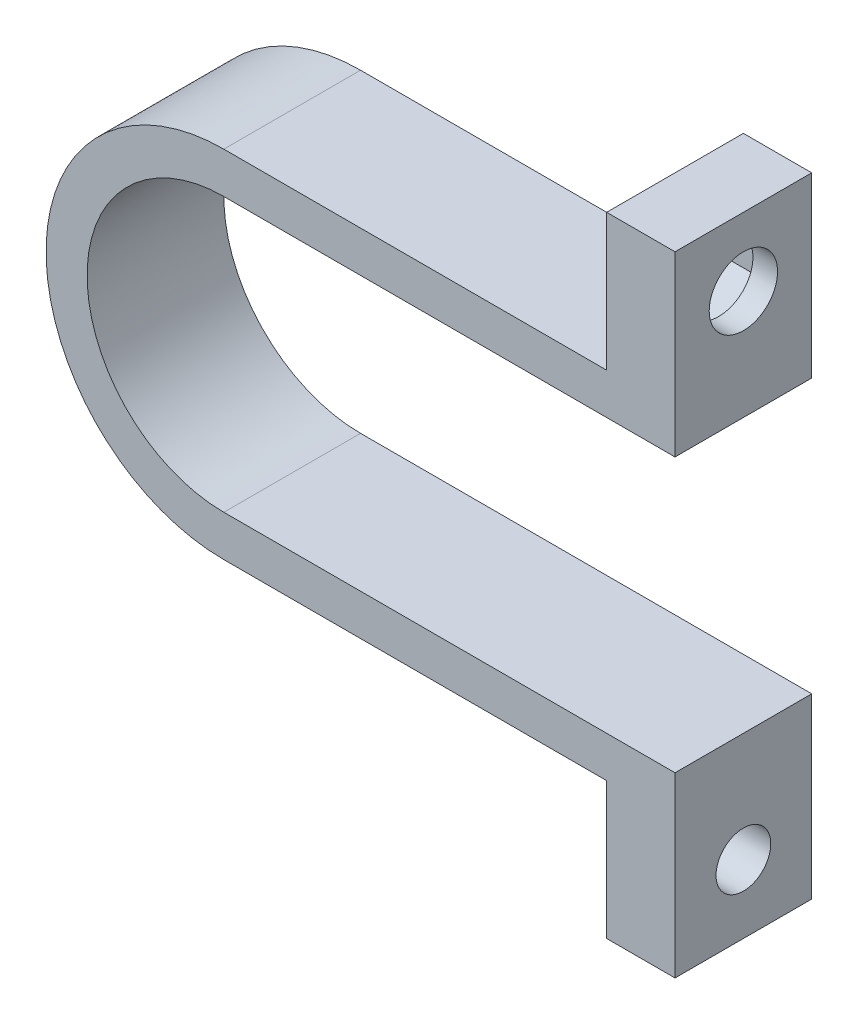
ISO-10303-21;
HEADER;
FILE_DESCRIPTION(('STEP AP214'),'2;1');
FILE_NAME('part.step','',(''),(''),'','','');
FILE_SCHEMA(('AUTOMOTIVE_DESIGN { 1 0 10303 214 1 1 1 1 }'));
ENDSEC;
DATA;
#1=APPLICATION_CONTEXT('core data for automotive mechanical design processes');
#2=APPLICATION_PROTOCOL_DEFINITION('international standard','automotive_design',2000,#1);
#3=PRODUCT_CONTEXT('',#1,'mechanical');
#4=PRODUCT('Part','Part','',(#3));
#5=PRODUCT_RELATED_PRODUCT_CATEGORY('part','',(#4));
#6=PRODUCT_DEFINITION_FORMATION('','',#4);
#7=PRODUCT_DEFINITION_CONTEXT('part definition',#1,'design');
#8=PRODUCT_DEFINITION('design','',#6,#7);
#9=PRODUCT_DEFINITION_SHAPE('','',#8);
#10=(LENGTH_UNIT() NAMED_UNIT(*) SI_UNIT(.MILLI.,.METRE.));
#11=(NAMED_UNIT(*) PLANE_ANGLE_UNIT() SI_UNIT($,.RADIAN.));
#12=(NAMED_UNIT(*) SI_UNIT($,.STERADIAN.) SOLID_ANGLE_UNIT());
#13=UNCERTAINTY_MEASURE_WITH_UNIT(LENGTH_MEASURE(1.E-05),#10,'distance_accuracy_value','');
#14=(GEOMETRIC_REPRESENTATION_CONTEXT(3) GLOBAL_UNCERTAINTY_ASSIGNED_CONTEXT((#13)) GLOBAL_UNIT_ASSIGNED_CONTEXT((#10,
#11,#12)) REPRESENTATION_CONTEXT('',''));
#15=CARTESIAN_POINT('',(0.,0.,0.));
#16=DIRECTION('',(0.,0.,1.));
#17=DIRECTION('',(1.,0.,0.));
#18=AXIS2_PLACEMENT_3D('',#15,#16,#17);
#19=CARTESIAN_POINT('',(0.,0.,10.));
#20=DIRECTION('',(0.,0.,-1.));
#21=DIRECTION('',(-1.,0.,0.));
#22=AXIS2_PLACEMENT_3D('',#19,#20,#21);
#23=CYLINDRICAL_SURFACE('',#22,10.);
#24=CARTESIAN_POINT('',(0.,0.,0.));
#25=DIRECTION('',(0.,0.,-1.));
#26=DIRECTION('',(1.,0.,0.));
#27=AXIS2_PLACEMENT_3D('',#24,#25,#26);
#28=CIRCLE('',#27,10.);
#29=CARTESIAN_POINT('',(0.,-10.,0.));
#30=VERTEX_POINT('',#29);
#31=CARTESIAN_POINT('',(0.,10.,0.));
#32=VERTEX_POINT('',#31);
#33=EDGE_CURVE('E166',#30,#32,#28,.T.);
#34=ORIENTED_EDGE('',*,*,#33,.T.);
#35=DIRECTION('',(0.,0.,-1.));
#36=VECTOR('',#35,1.);
#37=CARTESIAN_POINT('',(0.,10.,10.));
#38=LINE('',#37,#36);
#39=CARTESIAN_POINT('',(0.,10.,10.));
#40=VERTEX_POINT('',#39);
#41=EDGE_CURVE('E11',#40,#32,#38,.T.);
#42=ORIENTED_EDGE('',*,*,#41,.F.);
#43=CARTESIAN_POINT('',(0.,0.,10.));
#44=DIRECTION('',(0.,0.,-1.));
#45=DIRECTION('',(1.,0.,0.));
#46=AXIS2_PLACEMENT_3D('',#43,#44,#45);
#47=CIRCLE('',#46,10.);
#48=CARTESIAN_POINT('',(0.,-10.,10.));
#49=VERTEX_POINT('',#48);
#50=EDGE_CURVE('E190',#49,#40,#47,.T.);
#51=ORIENTED_EDGE('',*,*,#50,.F.);
#52=DIRECTION('',(0.,0.,-1.));
#53=VECTOR('',#52,1.);
#54=CARTESIAN_POINT('',(0.,-10.,10.));
#55=LINE('',#54,#53);
#56=EDGE_CURVE('E162',#49,#30,#55,.T.);
#57=ORIENTED_EDGE('',*,*,#56,.T.);
#58=EDGE_LOOP('',(#34,#42,#51,#57));
#59=FACE_BOUND('',#58,.T.);
#60=ADVANCED_FACE('F33',(#59),#23,.F.);
#61=CARTESIAN_POINT('',(33.,10.,10.));
#62=DIRECTION('',(0.,1.,0.));
#63=DIRECTION('',(-1.,0.,0.));
#64=AXIS2_PLACEMENT_3D('',#61,#62,#63);
#65=PLANE('',#64);
#66=DIRECTION('',(1.,0.,0.));
#67=VECTOR('',#66,1.);
#68=CARTESIAN_POINT('',(33.,10.,0.));
#69=LINE('',#68,#67);
#70=CARTESIAN_POINT('',(33.,10.,0.));
#71=VERTEX_POINT('',#70);
#72=EDGE_CURVE('E169',#32,#71,#69,.T.);
#73=ORIENTED_EDGE('',*,*,#72,.T.);
#74=DIRECTION('',(0.,0.,-1.));
#75=VECTOR('',#74,1.);
#76=CARTESIAN_POINT('',(33.,10.,10.));
#77=LINE('',#76,#75);
#78=CARTESIAN_POINT('',(33.,10.,10.));
#79=VERTEX_POINT('',#78);
#80=EDGE_CURVE('E41',#79,#71,#77,.T.);
#81=ORIENTED_EDGE('',*,*,#80,.F.);
#82=DIRECTION('',(1.,0.,0.));
#83=VECTOR('',#82,1.);
#84=CARTESIAN_POINT('',(33.,10.,10.));
#85=LINE('',#84,#83);
#86=EDGE_CURVE('E110',#40,#79,#85,.T.);
#87=ORIENTED_EDGE('',*,*,#86,.F.);
#88=ORIENTED_EDGE('',*,*,#41,.T.);
#89=EDGE_LOOP('',(#73,#81,#87,#88));
#90=FACE_BOUND('',#89,.T.);
#91=ADVANCED_FACE('F339',(#90),#65,.F.);
#92=CARTESIAN_POINT('',(33.,23.,10.));
#93=DIRECTION('',(-1.,0.,0.));
#94=DIRECTION('',(0.,0.,1.));
#95=AXIS2_PLACEMENT_3D('',#92,#93,#94);
#96=PLANE('',#95);
#97=CARTESIAN_POINT('',(33.,18.,5.));
#98=DIRECTION('',(-1.,0.,0.));
#99=DIRECTION('',(0.,0.,1.));
#100=AXIS2_PLACEMENT_3D('',#97,#98,#99);
#101=CIRCLE('',#100,2.5);
#102=CARTESIAN_POINT('',(33.,18.,7.5));
#103=VERTEX_POINT('',#102);
#104=EDGE_CURVE('E311',#103,#103,#101,.T.);
#105=ORIENTED_EDGE('',*,*,#104,.T.);
#106=EDGE_LOOP('',(#105));
#107=FACE_BOUND('',#106,.T.);
#108=DIRECTION('',(0.,1.,0.));
#109=VECTOR('',#108,1.);
#110=CARTESIAN_POINT('',(33.,23.,0.));
#111=LINE('',#110,#109);
#112=CARTESIAN_POINT('',(33.,23.,0.));
#113=VERTEX_POINT('',#112);
#114=EDGE_CURVE('E172',#71,#113,#111,.T.);
#115=ORIENTED_EDGE('',*,*,#114,.T.);
#116=DIRECTION('',(0.,0.,-1.));
#117=VECTOR('',#116,1.);
#118=CARTESIAN_POINT('',(33.,23.,10.));
#119=LINE('',#118,#117);
#120=CARTESIAN_POINT('',(33.,23.,10.));
#121=VERTEX_POINT('',#120);
#122=EDGE_CURVE('E209',#121,#113,#119,.T.);
#123=ORIENTED_EDGE('',*,*,#122,.F.);
#124=DIRECTION('',(0.,1.,0.));
#125=VECTOR('',#124,1.);
#126=CARTESIAN_POINT('',(33.,23.,10.));
#127=LINE('',#126,#125);
#128=EDGE_CURVE('E218',#79,#121,#127,.T.);
#129=ORIENTED_EDGE('',*,*,#128,.F.);
#130=ORIENTED_EDGE('',*,*,#80,.T.);
#131=EDGE_LOOP('',(#115,#123,#129,#130));
#132=FACE_BOUND('',#131,.T.);
#133=ADVANCED_FACE('F216',(#107,#132),#96,.F.);
#134=CARTESIAN_POINT('',(28.,23.,10.));
#135=DIRECTION('',(0.,-1.,0.));
#136=DIRECTION('',(0.,0.,-1.));
#137=AXIS2_PLACEMENT_3D('',#134,#135,#136);
#138=PLANE('',#137);
#139=DIRECTION('',(-1.,0.,0.));
#140=VECTOR('',#139,1.);
#141=CARTESIAN_POINT('',(28.,23.,0.));
#142=LINE('',#141,#140);
#143=CARTESIAN_POINT('',(28.,23.,0.));
#144=VERTEX_POINT('',#143);
#145=EDGE_CURVE('E174',#113,#144,#142,.T.);
#146=ORIENTED_EDGE('',*,*,#145,.T.);
#147=DIRECTION('',(0.,0.,-1.));
#148=VECTOR('',#147,1.);
#149=CARTESIAN_POINT('',(28.,23.,10.));
#150=LINE('',#149,#148);
#151=CARTESIAN_POINT('',(28.,23.,10.));
#152=VERTEX_POINT('',#151);
#153=EDGE_CURVE('E206',#152,#144,#150,.T.);
#154=ORIENTED_EDGE('',*,*,#153,.F.);
#155=DIRECTION('',(-1.,0.,0.));
#156=VECTOR('',#155,1.);
#157=CARTESIAN_POINT('',(28.,23.,10.));
#158=LINE('',#157,#156);
#159=EDGE_CURVE('E236',#121,#152,#158,.T.);
#160=ORIENTED_EDGE('',*,*,#159,.F.);
#161=ORIENTED_EDGE('',*,*,#122,.T.);
#162=EDGE_LOOP('',(#146,#154,#160,#161));
#163=FACE_BOUND('',#162,.T.);
#164=ADVANCED_FACE('F227',(#163),#138,.F.);
#165=CARTESIAN_POINT('',(28.,13.,10.));
#166=DIRECTION('',(1.,0.,0.));
#167=DIRECTION('',(0.,0.,-1.));
#168=AXIS2_PLACEMENT_3D('',#165,#166,#167);
#169=PLANE('',#168);
#170=DIRECTION('',(0.,1.,0.));
#171=VECTOR('',#170,1.);
#172=CARTESIAN_POINT('',(28.,15.9792740578363,8.5));
#173=LINE('',#172,#171);
#174=CARTESIAN_POINT('',(28.,15.9792740578363,8.5));
#175=VERTEX_POINT('',#174);
#176=CARTESIAN_POINT('',(28.,20.0207259421637,8.5));
#177=VERTEX_POINT('',#176);
#178=EDGE_CURVE('E291',#175,#177,#173,.T.);
#179=ORIENTED_EDGE('',*,*,#178,.F.);
#180=DIRECTION('',(0.,0.5,0.866025403784439));
#181=VECTOR('',#180,1.);
#182=CARTESIAN_POINT('',(28.,13.9585481156726,5.));
#183=LINE('',#182,#181);
#184=CARTESIAN_POINT('',(28.,13.9585481156726,5.));
#185=VERTEX_POINT('',#184);
#186=EDGE_CURVE('E48',#185,#175,#183,.T.);
#187=ORIENTED_EDGE('',*,*,#186,.F.);
#188=DIRECTION('',(0.,-0.5,0.866025403784438));
#189=VECTOR('',#188,1.);
#190=CARTESIAN_POINT('',(28.,15.9792740578363,1.5));
#191=LINE('',#190,#189);
#192=CARTESIAN_POINT('',(28.,15.9792740578363,1.5));
#193=VERTEX_POINT('',#192);
#194=EDGE_CURVE('E278',#193,#185,#191,.T.);
#195=ORIENTED_EDGE('',*,*,#194,.F.);
#196=DIRECTION('',(0.,-1.,0.));
#197=VECTOR('',#196,1.);
#198=CARTESIAN_POINT('',(28.,20.0207259421637,1.5));
#199=LINE('',#198,#197);
#200=CARTESIAN_POINT('',(28.,20.0207259421637,1.5));
#201=VERTEX_POINT('',#200);
#202=EDGE_CURVE('E282',#201,#193,#199,.T.);
#203=ORIENTED_EDGE('',*,*,#202,.F.);
#204=DIRECTION('',(0.,-0.500000000000001,-0.866025403784438));
#205=VECTOR('',#204,1.);
#206=CARTESIAN_POINT('',(28.,22.0414518843274,5.));
#207=LINE('',#206,#205);
#208=CARTESIAN_POINT('',(28.,22.0414518843274,5.));
#209=VERTEX_POINT('',#208);
#210=EDGE_CURVE('E285',#209,#201,#207,.T.);
#211=ORIENTED_EDGE('',*,*,#210,.F.);
#212=DIRECTION('',(0.,0.5,-0.866025403784439));
#213=VECTOR('',#212,1.);
#214=CARTESIAN_POINT('',(28.,20.0207259421637,8.5));
#215=LINE('',#214,#213);
#216=EDGE_CURVE('E288',#177,#209,#215,.T.);
#217=ORIENTED_EDGE('',*,*,#216,.F.);
#218=EDGE_LOOP('',(#179,#187,#195,#203,#211,#217));
#219=FACE_BOUND('',#218,.T.);
#220=DIRECTION('',(0.,-1.,0.));
#221=VECTOR('',#220,1.);
#222=CARTESIAN_POINT('',(28.,13.,0.));
#223=LINE('',#222,#221);
#224=CARTESIAN_POINT('',(28.,13.,0.));
#225=VERTEX_POINT('',#224);
#226=EDGE_CURVE('E176',#144,#225,#223,.T.);
#227=ORIENTED_EDGE('',*,*,#226,.T.);
#228=DIRECTION('',(0.,0.,-1.));
#229=VECTOR('',#228,1.);
#230=CARTESIAN_POINT('',(28.,13.,10.));
#231=LINE('',#230,#229);
#232=CARTESIAN_POINT('',(28.,13.,10.));
#233=VERTEX_POINT('',#232);
#234=EDGE_CURVE('E203',#233,#225,#231,.T.);
#235=ORIENTED_EDGE('',*,*,#234,.F.);
#236=DIRECTION('',(0.,-1.,0.));
#237=VECTOR('',#236,1.);
#238=CARTESIAN_POINT('',(28.,13.,10.));
#239=LINE('',#238,#237);
#240=EDGE_CURVE('E233',#152,#233,#239,.T.);
#241=ORIENTED_EDGE('',*,*,#240,.F.);
#242=ORIENTED_EDGE('',*,*,#153,.T.);
#243=EDGE_LOOP('',(#227,#235,#241,#242));
#244=FACE_BOUND('',#243,.T.);
#245=ADVANCED_FACE('F231',(#219,#244),#169,.F.);
#246=CARTESIAN_POINT('',(0.,13.,10.));
#247=DIRECTION('',(0.,-1.,0.));
#248=DIRECTION('',(0.,0.,-1.));
#249=AXIS2_PLACEMENT_3D('',#246,#247,#248);
#250=PLANE('',#249);
#251=DIRECTION('',(-1.,0.,0.));
#252=VECTOR('',#251,1.);
#253=CARTESIAN_POINT('',(0.,13.,0.));
#254=LINE('',#253,#252);
#255=CARTESIAN_POINT('',(0.,13.,0.));
#256=VERTEX_POINT('',#255);
#257=EDGE_CURVE('E178',#225,#256,#254,.T.);
#258=ORIENTED_EDGE('',*,*,#257,.T.);
#259=DIRECTION('',(0.,0.,-1.));
#260=VECTOR('',#259,1.);
#261=CARTESIAN_POINT('',(0.,13.,10.));
#262=LINE('',#261,#260);
#263=CARTESIAN_POINT('',(0.,13.,10.));
#264=VERTEX_POINT('',#263);
#265=EDGE_CURVE('E200',#264,#256,#262,.T.);
#266=ORIENTED_EDGE('',*,*,#265,.F.);
#267=DIRECTION('',(-1.,0.,0.));
#268=VECTOR('',#267,1.);
#269=CARTESIAN_POINT('',(0.,13.,10.));
#270=LINE('',#269,#268);
#271=EDGE_CURVE('E235',#233,#264,#270,.T.);
#272=ORIENTED_EDGE('',*,*,#271,.F.);
#273=ORIENTED_EDGE('',*,*,#234,.T.);
#274=EDGE_LOOP('',(#258,#266,#272,#273));
#275=FACE_BOUND('',#274,.T.);
#276=ADVANCED_FACE('F353',(#275),#250,.F.);
#277=CARTESIAN_POINT('',(0.,0.,10.));
#278=DIRECTION('',(0.,0.,-1.));
#279=DIRECTION('',(-1.,0.,0.));
#280=AXIS2_PLACEMENT_3D('',#277,#278,#279);
#281=CYLINDRICAL_SURFACE('',#280,13.);
#282=CARTESIAN_POINT('',(0.,0.,0.));
#283=DIRECTION('',(0.,0.,1.));
#284=DIRECTION('',(1.,0.,0.));
#285=AXIS2_PLACEMENT_3D('',#282,#283,#284);
#286=CIRCLE('',#285,13.);
#287=CARTESIAN_POINT('',(0.,-13.,0.));
#288=VERTEX_POINT('',#287);
#289=EDGE_CURVE('E180',#256,#288,#286,.T.);
#290=ORIENTED_EDGE('',*,*,#289,.T.);
#291=DIRECTION('',(0.,0.,-1.));
#292=VECTOR('',#291,1.);
#293=CARTESIAN_POINT('',(0.,-13.,10.));
#294=LINE('',#293,#292);
#295=CARTESIAN_POINT('',(0.,-13.,10.));
#296=VERTEX_POINT('',#295);
#297=EDGE_CURVE('E197',#296,#288,#294,.T.);
#298=ORIENTED_EDGE('',*,*,#297,.F.);
#299=CARTESIAN_POINT('',(0.,0.,10.));
#300=DIRECTION('',(0.,0.,1.));
#301=DIRECTION('',(1.,0.,0.));
#302=AXIS2_PLACEMENT_3D('',#299,#300,#301);
#303=CIRCLE('',#302,13.);
#304=EDGE_CURVE('E238',#264,#296,#303,.T.);
#305=ORIENTED_EDGE('',*,*,#304,.F.);
#306=ORIENTED_EDGE('',*,*,#265,.T.);
#307=EDGE_LOOP('',(#290,#298,#305,#306));
#308=FACE_BOUND('',#307,.T.);
#309=ADVANCED_FACE('F336',(#308),#281,.T.);
#310=CARTESIAN_POINT('',(0.,-13.,10.));
#311=DIRECTION('',(0.,1.,0.));
#312=DIRECTION('',(0.,0.,1.));
#313=AXIS2_PLACEMENT_3D('',#310,#311,#312);
#314=PLANE('',#313);
#315=DIRECTION('',(1.,0.,0.));
#316=VECTOR('',#315,1.);
#317=CARTESIAN_POINT('',(0.,-13.,0.));
#318=LINE('',#317,#316);
#319=CARTESIAN_POINT('',(28.,-13.,0.));
#320=VERTEX_POINT('',#319);
#321=EDGE_CURVE('E182',#288,#320,#318,.T.);
#322=ORIENTED_EDGE('',*,*,#321,.T.);
#323=DIRECTION('',(0.,0.,-1.));
#324=VECTOR('',#323,1.);
#325=CARTESIAN_POINT('',(28.,-13.,10.));
#326=LINE('',#325,#324);
#327=CARTESIAN_POINT('',(28.,-13.,10.));
#328=VERTEX_POINT('',#327);
#329=EDGE_CURVE('E194',#328,#320,#326,.T.);
#330=ORIENTED_EDGE('',*,*,#329,.F.);
#331=DIRECTION('',(1.,0.,0.));
#332=VECTOR('',#331,1.);
#333=CARTESIAN_POINT('',(0.,-13.,10.));
#334=LINE('',#333,#332);
#335=EDGE_CURVE('E244',#296,#328,#334,.T.);
#336=ORIENTED_EDGE('',*,*,#335,.F.);
#337=ORIENTED_EDGE('',*,*,#297,.T.);
#338=EDGE_LOOP('',(#322,#330,#336,#337));
#339=FACE_BOUND('',#338,.T.);
#340=ADVANCED_FACE('F250',(#339),#314,.F.);
#341=CARTESIAN_POINT('',(28.,-13.,10.));
#342=DIRECTION('',(1.,0.,0.));
#343=DIRECTION('',(0.,0.,-1.));
#344=AXIS2_PLACEMENT_3D('',#341,#342,#343);
#345=PLANE('',#344);
#346=CARTESIAN_POINT('',(28.,-18.,5.));
#347=DIRECTION('',(-1.,0.,0.));
#348=DIRECTION('',(0.,0.,1.));
#349=AXIS2_PLACEMENT_3D('',#346,#347,#348);
#350=CIRCLE('',#349,2.);
#351=CARTESIAN_POINT('',(28.,-18.,7.));
#352=VERTEX_POINT('',#351);
#353=EDGE_CURVE('E315',#352,#352,#350,.T.);
#354=ORIENTED_EDGE('',*,*,#353,.F.);
#355=EDGE_LOOP('',(#354));
#356=FACE_BOUND('',#355,.T.);
#357=DIRECTION('',(0.,-1.,0.));
#358=VECTOR('',#357,1.);
#359=CARTESIAN_POINT('',(28.,-13.,0.));
#360=LINE('',#359,#358);
#361=CARTESIAN_POINT('',(28.,-23.,0.));
#362=VERTEX_POINT('',#361);
#363=EDGE_CURVE('E184',#320,#362,#360,.T.);
#364=ORIENTED_EDGE('',*,*,#363,.T.);
#365=DIRECTION('',(0.,0.,-1.));
#366=VECTOR('',#365,1.);
#367=CARTESIAN_POINT('',(28.,-23.,10.));
#368=LINE('',#367,#366);
#369=CARTESIAN_POINT('',(28.,-23.,10.));
#370=VERTEX_POINT('',#369);
#371=EDGE_CURVE('E157',#370,#362,#368,.T.);
#372=ORIENTED_EDGE('',*,*,#371,.F.);
#373=DIRECTION('',(0.,-1.,0.));
#374=VECTOR('',#373,1.);
#375=CARTESIAN_POINT('',(28.,-13.,10.));
#376=LINE('',#375,#374);
#377=EDGE_CURVE('E145',#328,#370,#376,.T.);
#378=ORIENTED_EDGE('',*,*,#377,.F.);
#379=ORIENTED_EDGE('',*,*,#329,.T.);
#380=EDGE_LOOP('',(#364,#372,#378,#379));
#381=FACE_BOUND('',#380,.T.);
#382=ADVANCED_FACE('F254',(#356,#381),#345,.F.);
#383=CARTESIAN_POINT('',(28.,-23.,10.));
#384=DIRECTION('',(0.,1.,0.));
#385=DIRECTION('',(0.,0.,1.));
#386=AXIS2_PLACEMENT_3D('',#383,#384,#385);
#387=PLANE('',#386);
#388=DIRECTION('',(1.,0.,0.));
#389=VECTOR('',#388,1.);
#390=CARTESIAN_POINT('',(28.,-23.,0.));
#391=LINE('',#390,#389);
#392=CARTESIAN_POINT('',(33.,-23.,0.));
#393=VERTEX_POINT('',#392);
#394=EDGE_CURVE('E154',#362,#393,#391,.T.);
#395=ORIENTED_EDGE('',*,*,#394,.T.);
#396=DIRECTION('',(0.,0.,-1.));
#397=VECTOR('',#396,1.);
#398=CARTESIAN_POINT('',(33.,-23.,10.));
#399=LINE('',#398,#397);
#400=CARTESIAN_POINT('',(33.,-23.,10.));
#401=VERTEX_POINT('',#400);
#402=EDGE_CURVE('E151',#401,#393,#399,.T.);
#403=ORIENTED_EDGE('',*,*,#402,.F.);
#404=DIRECTION('',(1.,0.,0.));
#405=VECTOR('',#404,1.);
#406=CARTESIAN_POINT('',(28.,-23.,10.));
#407=LINE('',#406,#405);
#408=EDGE_CURVE('E138',#370,#401,#407,.T.);
#409=ORIENTED_EDGE('',*,*,#408,.F.);
#410=ORIENTED_EDGE('',*,*,#371,.T.);
#411=EDGE_LOOP('',(#395,#403,#409,#410));
#412=FACE_BOUND('',#411,.T.);
#413=ADVANCED_FACE('F152',(#412),#387,.F.);
#414=CARTESIAN_POINT('',(33.,-23.,10.));
#415=DIRECTION('',(-1.,0.,0.));
#416=DIRECTION('',(0.,0.,1.));
#417=AXIS2_PLACEMENT_3D('',#414,#415,#416);
#418=PLANE('',#417);
#419=CARTESIAN_POINT('',(33.,-18.,5.));
#420=DIRECTION('',(-1.,0.,0.));
#421=DIRECTION('',(0.,0.,1.));
#422=AXIS2_PLACEMENT_3D('',#419,#420,#421);
#423=CIRCLE('',#422,2.);
#424=CARTESIAN_POINT('',(33.,-18.,7.));
#425=VERTEX_POINT('',#424);
#426=EDGE_CURVE('E314',#425,#425,#423,.T.);
#427=ORIENTED_EDGE('',*,*,#426,.T.);
#428=EDGE_LOOP('',(#427));
#429=FACE_BOUND('',#428,.T.);
#430=DIRECTION('',(0.,1.,0.));
#431=VECTOR('',#430,1.);
#432=CARTESIAN_POINT('',(33.,-23.,0.));
#433=LINE('',#432,#431);
#434=CARTESIAN_POINT('',(33.,-10.,0.));
#435=VERTEX_POINT('',#434);
#436=EDGE_CURVE('E187',#393,#435,#433,.T.);
#437=ORIENTED_EDGE('',*,*,#436,.T.);
#438=DIRECTION('',(0.,0.,-1.));
#439=VECTOR('',#438,1.);
#440=CARTESIAN_POINT('',(33.,-10.,10.));
#441=LINE('',#440,#439);
#442=CARTESIAN_POINT('',(33.,-10.,10.));
#443=VERTEX_POINT('',#442);
#444=EDGE_CURVE('E158',#443,#435,#441,.T.);
#445=ORIENTED_EDGE('',*,*,#444,.F.);
#446=DIRECTION('',(0.,1.,0.));
#447=VECTOR('',#446,1.);
#448=CARTESIAN_POINT('',(33.,-23.,10.));
#449=LINE('',#448,#447);
#450=EDGE_CURVE('E142',#401,#443,#449,.T.);
#451=ORIENTED_EDGE('',*,*,#450,.F.);
#452=ORIENTED_EDGE('',*,*,#402,.T.);
#453=EDGE_LOOP('',(#437,#445,#451,#452));
#454=FACE_BOUND('',#453,.T.);
#455=ADVANCED_FACE('F160',(#429,#454),#418,.F.);
#456=CARTESIAN_POINT('',(33.,-10.,10.));
#457=DIRECTION('',(0.,-1.,0.));
#458=DIRECTION('',(1.,0.,0.));
#459=AXIS2_PLACEMENT_3D('',#456,#457,#458);
#460=PLANE('',#459);
#461=DIRECTION('',(-1.,0.,0.));
#462=VECTOR('',#461,1.);
#463=CARTESIAN_POINT('',(33.,-10.,0.));
#464=LINE('',#463,#462);
#465=EDGE_CURVE('E102',#435,#30,#464,.T.);
#466=ORIENTED_EDGE('',*,*,#465,.T.);
#467=ORIENTED_EDGE('',*,*,#56,.F.);
#468=DIRECTION('',(-1.,0.,0.));
#469=VECTOR('',#468,1.);
#470=CARTESIAN_POINT('',(33.,-10.,10.));
#471=LINE('',#470,#469);
#472=EDGE_CURVE('E57',#443,#49,#471,.T.);
#473=ORIENTED_EDGE('',*,*,#472,.F.);
#474=ORIENTED_EDGE('',*,*,#444,.T.);
#475=EDGE_LOOP('',(#466,#467,#473,#474));
#476=FACE_BOUND('',#475,.T.);
#477=ADVANCED_FACE('F255',(#476),#460,.F.);
#478=CARTESIAN_POINT('',(0.,0.,10.));
#479=DIRECTION('',(0.,0.,1.));
#480=DIRECTION('',(1.,0.,0.));
#481=AXIS2_PLACEMENT_3D('',#478,#479,#480);
#482=PLANE('',#481);
#483=ORIENTED_EDGE('',*,*,#50,.T.);
#484=ORIENTED_EDGE('',*,*,#86,.T.);
#485=ORIENTED_EDGE('',*,*,#128,.T.);
#486=ORIENTED_EDGE('',*,*,#159,.T.);
#487=ORIENTED_EDGE('',*,*,#240,.T.);
#488=ORIENTED_EDGE('',*,*,#271,.T.);
#489=ORIENTED_EDGE('',*,*,#304,.T.);
#490=ORIENTED_EDGE('',*,*,#335,.T.);
#491=ORIENTED_EDGE('',*,*,#377,.T.);
#492=ORIENTED_EDGE('',*,*,#408,.T.);
#493=ORIENTED_EDGE('',*,*,#450,.T.);
#494=ORIENTED_EDGE('',*,*,#472,.T.);
#495=EDGE_LOOP('',(#483,#484,#485,#486,#487,#488,#489,#490,#491,#492,#493,#494));
#496=FACE_BOUND('',#495,.T.);
#497=ADVANCED_FACE('F140',(#496),#482,.T.);
#498=CARTESIAN_POINT('',(0.,0.,0.));
#499=DIRECTION('',(0.,0.,1.));
#500=DIRECTION('',(1.,0.,0.));
#501=AXIS2_PLACEMENT_3D('',#498,#499,#500);
#502=PLANE('',#501);
#503=ORIENTED_EDGE('',*,*,#33,.F.);
#504=ORIENTED_EDGE('',*,*,#465,.F.);
#505=ORIENTED_EDGE('',*,*,#436,.F.);
#506=ORIENTED_EDGE('',*,*,#394,.F.);
#507=ORIENTED_EDGE('',*,*,#363,.F.);
#508=ORIENTED_EDGE('',*,*,#321,.F.);
#509=ORIENTED_EDGE('',*,*,#289,.F.);
#510=ORIENTED_EDGE('',*,*,#257,.F.);
#511=ORIENTED_EDGE('',*,*,#226,.F.);
#512=ORIENTED_EDGE('',*,*,#145,.F.);
#513=ORIENTED_EDGE('',*,*,#114,.F.);
#514=ORIENTED_EDGE('',*,*,#72,.F.);
#515=EDGE_LOOP('',(#503,#504,#505,#506,#507,#508,#509,#510,#511,#512,#513,#514));
#516=FACE_BOUND('',#515,.T.);
#517=ADVANCED_FACE('F222',(#516),#502,.F.);
#518=CARTESIAN_POINT('',(31.2,13.9585481156726,5.));
#519=DIRECTION('',(0.,-0.866025403784439,0.5));
#520=DIRECTION('',(0.,-0.5,-0.866025403784439));
#521=AXIS2_PLACEMENT_3D('',#518,#519,#520);
#522=PLANE('',#521);
#523=ORIENTED_EDGE('',*,*,#186,.T.);
#524=DIRECTION('',(-1.,0.,0.));
#525=VECTOR('',#524,1.);
#526=CARTESIAN_POINT('',(31.2,15.9792740578363,8.5));
#527=LINE('',#526,#525);
#528=CARTESIAN_POINT('',(31.2,15.9792740578363,8.5));
#529=VERTEX_POINT('',#528);
#530=EDGE_CURVE('E262',#529,#175,#527,.T.);
#531=ORIENTED_EDGE('',*,*,#530,.F.);
#532=DIRECTION('',(0.,0.5,0.866025403784439));
#533=VECTOR('',#532,1.);
#534=CARTESIAN_POINT('',(31.2,13.9585481156726,5.));
#535=LINE('',#534,#533);
#536=CARTESIAN_POINT('',(31.2,13.9585481156726,5.));
#537=VERTEX_POINT('',#536);
#538=EDGE_CURVE('E281',#537,#529,#535,.T.);
#539=ORIENTED_EDGE('',*,*,#538,.F.);
#540=DIRECTION('',(-1.,0.,0.));
#541=VECTOR('',#540,1.);
#542=CARTESIAN_POINT('',(31.2,13.9585481156726,5.));
#543=LINE('',#542,#541);
#544=EDGE_CURVE('E170',#537,#185,#543,.T.);
#545=ORIENTED_EDGE('',*,*,#544,.T.);
#546=EDGE_LOOP('',(#523,#531,#539,#545));
#547=FACE_BOUND('',#546,.T.);
#548=ADVANCED_FACE('F404',(#547),#522,.F.);
#549=CARTESIAN_POINT('',(31.2,15.9792740578363,1.5));
#550=DIRECTION('',(0.,-0.866025403784438,-0.5));
#551=DIRECTION('',(0.,0.5,-0.866025403784439));
#552=AXIS2_PLACEMENT_3D('',#549,#550,#551);
#553=PLANE('',#552);
#554=ORIENTED_EDGE('',*,*,#194,.T.);
#555=ORIENTED_EDGE('',*,*,#544,.F.);
#556=DIRECTION('',(0.,-0.5,0.866025403784438));
#557=VECTOR('',#556,1.);
#558=CARTESIAN_POINT('',(31.2,15.9792740578363,1.5));
#559=LINE('',#558,#557);
#560=CARTESIAN_POINT('',(31.2,15.9792740578363,1.5));
#561=VERTEX_POINT('',#560);
#562=EDGE_CURVE('E265',#561,#537,#559,.T.);
#563=ORIENTED_EDGE('',*,*,#562,.F.);
#564=DIRECTION('',(-1.,0.,0.));
#565=VECTOR('',#564,1.);
#566=CARTESIAN_POINT('',(31.2,15.9792740578363,1.5));
#567=LINE('',#566,#565);
#568=EDGE_CURVE('E274',#561,#193,#567,.T.);
#569=ORIENTED_EDGE('',*,*,#568,.T.);
#570=EDGE_LOOP('',(#554,#555,#563,#569));
#571=FACE_BOUND('',#570,.T.);
#572=ADVANCED_FACE('F421',(#571),#553,.F.);
#573=CARTESIAN_POINT('',(31.2,20.0207259421637,1.5));
#574=DIRECTION('',(0.,0.,-1.));
#575=DIRECTION('',(-1.,0.,0.));
#576=AXIS2_PLACEMENT_3D('',#573,#574,#575);
#577=PLANE('',#576);
#578=ORIENTED_EDGE('',*,*,#202,.T.);
#579=ORIENTED_EDGE('',*,*,#568,.F.);
#580=DIRECTION('',(0.,-1.,0.));
#581=VECTOR('',#580,1.);
#582=CARTESIAN_POINT('',(31.2,20.0207259421637,1.5));
#583=LINE('',#582,#581);
#584=CARTESIAN_POINT('',(31.2,20.0207259421637,1.5));
#585=VERTEX_POINT('',#584);
#586=EDGE_CURVE('E297',#585,#561,#583,.T.);
#587=ORIENTED_EDGE('',*,*,#586,.F.);
#588=DIRECTION('',(-1.,0.,0.));
#589=VECTOR('',#588,1.);
#590=CARTESIAN_POINT('',(31.2,20.0207259421637,1.5));
#591=LINE('',#590,#589);
#592=EDGE_CURVE('E271',#585,#201,#591,.T.);
#593=ORIENTED_EDGE('',*,*,#592,.T.);
#594=EDGE_LOOP('',(#578,#579,#587,#593));
#595=FACE_BOUND('',#594,.T.);
#596=ADVANCED_FACE('F430',(#595),#577,.F.);
#597=CARTESIAN_POINT('',(31.2,22.0414518843274,5.));
#598=DIRECTION('',(0.,0.866025403784438,-0.500000000000001));
#599=DIRECTION('',(0.,0.500000000000001,0.866025403784438));
#600=AXIS2_PLACEMENT_3D('',#597,#598,#599);
#601=PLANE('',#600);
#602=ORIENTED_EDGE('',*,*,#210,.T.);
#603=ORIENTED_EDGE('',*,*,#592,.F.);
#604=DIRECTION('',(0.,-0.500000000000001,-0.866025403784438));
#605=VECTOR('',#604,1.);
#606=CARTESIAN_POINT('',(31.2,22.0414518843274,5.));
#607=LINE('',#606,#605);
#608=CARTESIAN_POINT('',(31.2,22.0414518843274,5.));
#609=VERTEX_POINT('',#608);
#610=EDGE_CURVE('E300',#609,#585,#607,.T.);
#611=ORIENTED_EDGE('',*,*,#610,.F.);
#612=DIRECTION('',(-1.,0.,0.));
#613=VECTOR('',#612,1.);
#614=CARTESIAN_POINT('',(31.2,22.0414518843274,5.));
#615=LINE('',#614,#613);
#616=EDGE_CURVE('E268',#609,#209,#615,.T.);
#617=ORIENTED_EDGE('',*,*,#616,.T.);
#618=EDGE_LOOP('',(#602,#603,#611,#617));
#619=FACE_BOUND('',#618,.T.);
#620=ADVANCED_FACE('F440',(#619),#601,.F.);
#621=CARTESIAN_POINT('',(31.2,20.0207259421637,8.5));
#622=DIRECTION('',(0.,0.866025403784438,0.5));
#623=DIRECTION('',(0.,-0.5,0.866025403784439));
#624=AXIS2_PLACEMENT_3D('',#621,#622,#623);
#625=PLANE('',#624);
#626=ORIENTED_EDGE('',*,*,#216,.T.);
#627=ORIENTED_EDGE('',*,*,#616,.F.);
#628=DIRECTION('',(0.,0.5,-0.866025403784439));
#629=VECTOR('',#628,1.);
#630=CARTESIAN_POINT('',(31.2,20.0207259421637,8.5));
#631=LINE('',#630,#629);
#632=CARTESIAN_POINT('',(31.2,20.0207259421637,8.5));
#633=VERTEX_POINT('',#632);
#634=EDGE_CURVE('E303',#633,#609,#631,.T.);
#635=ORIENTED_EDGE('',*,*,#634,.F.);
#636=DIRECTION('',(-1.,0.,0.));
#637=VECTOR('',#636,1.);
#638=CARTESIAN_POINT('',(31.2,20.0207259421637,8.5));
#639=LINE('',#638,#637);
#640=EDGE_CURVE('E264',#633,#177,#639,.T.);
#641=ORIENTED_EDGE('',*,*,#640,.T.);
#642=EDGE_LOOP('',(#626,#627,#635,#641));
#643=FACE_BOUND('',#642,.T.);
#644=ADVANCED_FACE('F450',(#643),#625,.F.);
#645=CARTESIAN_POINT('',(31.2,15.9792740578363,8.5));
#646=DIRECTION('',(0.,0.,1.));
#647=DIRECTION('',(1.,0.,0.));
#648=AXIS2_PLACEMENT_3D('',#645,#646,#647);
#649=PLANE('',#648);
#650=ORIENTED_EDGE('',*,*,#178,.T.);
#651=ORIENTED_EDGE('',*,*,#640,.F.);
#652=DIRECTION('',(0.,1.,0.));
#653=VECTOR('',#652,1.);
#654=CARTESIAN_POINT('',(31.2,15.9792740578363,8.5));
#655=LINE('',#654,#653);
#656=EDGE_CURVE('E306',#529,#633,#655,.T.);
#657=ORIENTED_EDGE('',*,*,#656,.F.);
#658=ORIENTED_EDGE('',*,*,#530,.T.);
#659=EDGE_LOOP('',(#650,#651,#657,#658));
#660=FACE_BOUND('',#659,.T.);
#661=ADVANCED_FACE('F460',(#660),#649,.F.);
#662=CARTESIAN_POINT('',(31.2,0.,0.));
#663=DIRECTION('',(-1.,0.,0.));
#664=DIRECTION('',(0.,0.,1.));
#665=AXIS2_PLACEMENT_3D('',#662,#663,#664);
#666=PLANE('',#665);
#667=CARTESIAN_POINT('',(31.2,18.,5.));
#668=DIRECTION('',(-1.,0.,0.));
#669=DIRECTION('',(0.,0.,1.));
#670=AXIS2_PLACEMENT_3D('',#667,#668,#669);
#671=CIRCLE('',#670,2.5);
#672=CARTESIAN_POINT('',(31.2,18.,7.5));
#673=VERTEX_POINT('',#672);
#674=EDGE_CURVE('E36',#673,#673,#671,.T.);
#675=ORIENTED_EDGE('',*,*,#674,.F.);
#676=EDGE_LOOP('',(#675));
#677=FACE_BOUND('',#676,.T.);
#678=ORIENTED_EDGE('',*,*,#538,.T.);
#679=ORIENTED_EDGE('',*,*,#656,.T.);
#680=ORIENTED_EDGE('',*,*,#634,.T.);
#681=ORIENTED_EDGE('',*,*,#610,.T.);
#682=ORIENTED_EDGE('',*,*,#586,.T.);
#683=ORIENTED_EDGE('',*,*,#562,.T.);
#684=EDGE_LOOP('',(#678,#679,#680,#681,#682,#683));
#685=FACE_BOUND('',#684,.T.);
#686=ADVANCED_FACE('F470',(#677,#685),#666,.T.);
#687=CARTESIAN_POINT('',(33.,18.,5.));
#688=DIRECTION('',(-1.,0.,0.));
#689=DIRECTION('',(0.,0.,1.));
#690=AXIS2_PLACEMENT_3D('',#687,#688,#689);
#691=CYLINDRICAL_SURFACE('',#690,2.5);
#692=ORIENTED_EDGE('',*,*,#674,.T.);
#693=EDGE_LOOP('',(#692));
#694=FACE_BOUND('',#693,.T.);
#695=ORIENTED_EDGE('',*,*,#104,.F.);
#696=EDGE_LOOP('',(#695));
#697=FACE_BOUND('',#696,.T.);
#698=ADVANCED_FACE('F325',(#694,#697),#691,.F.);
#699=CARTESIAN_POINT('',(33.,-18.,5.));
#700=DIRECTION('',(-1.,0.,0.));
#701=DIRECTION('',(0.,0.,1.));
#702=AXIS2_PLACEMENT_3D('',#699,#700,#701);
#703=CYLINDRICAL_SURFACE('',#702,2.);
#704=ORIENTED_EDGE('',*,*,#426,.F.);
#705=EDGE_LOOP('',(#704));
#706=FACE_BOUND('',#705,.T.);
#707=ORIENTED_EDGE('',*,*,#353,.T.);
#708=EDGE_LOOP('',(#707));
#709=FACE_BOUND('',#708,.T.);
#710=ADVANCED_FACE('F322',(#706,#709),#703,.F.);
#711=CLOSED_SHELL('',(#60,#91,#133,#164,#245,#276,#309,#340,#382,#413,#455,#477,#497,#517,#548,
#572,#596,#620,#644,#661,#686,#698,#710));
#712=MANIFOLD_SOLID_BREP('B2',#711);
#713=ADVANCED_BREP_SHAPE_REPRESENTATION('',(#18,#712),#14);
#714=SHAPE_DEFINITION_REPRESENTATION(#9,#713);
ENDSEC;
END-ISO-10303-21;
